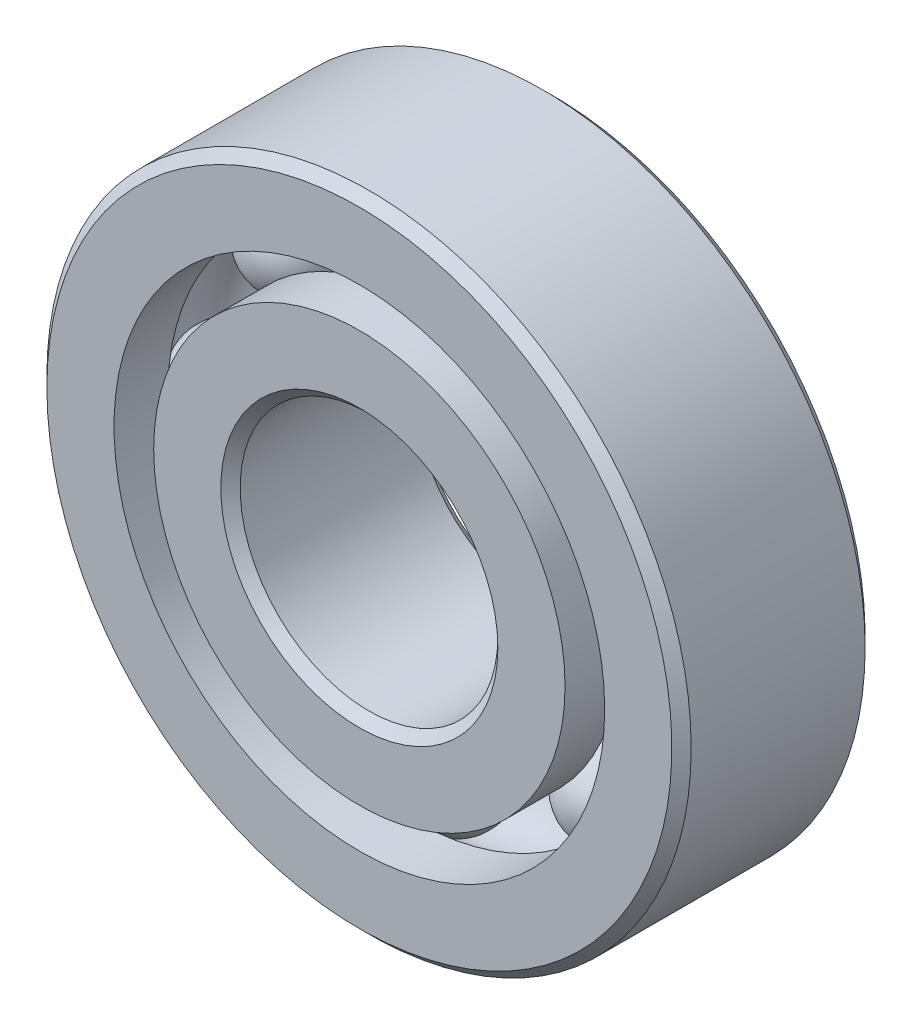
ISO-10303-21;
HEADER;
FILE_DESCRIPTION(('STEP AP214'),'2;1');
FILE_NAME('part.step','',(''),(''),'','','');
FILE_SCHEMA(('AUTOMOTIVE_DESIGN { 1 0 10303 214 1 1 1 1 }'));
ENDSEC;
DATA;
#1=APPLICATION_CONTEXT('core data for automotive mechanical design processes');
#2=APPLICATION_PROTOCOL_DEFINITION('international standard','automotive_design',2000,#1);
#3=PRODUCT_CONTEXT('',#1,'mechanical');
#4=PRODUCT('Part','Part','',(#3));
#5=PRODUCT_RELATED_PRODUCT_CATEGORY('part','',(#4));
#6=PRODUCT_DEFINITION_FORMATION('','',#4);
#7=PRODUCT_DEFINITION_CONTEXT('part definition',#1,'design');
#8=PRODUCT_DEFINITION('design','',#6,#7);
#9=PRODUCT_DEFINITION_SHAPE('','',#8);
#10=(LENGTH_UNIT() NAMED_UNIT(*) SI_UNIT(.MILLI.,.METRE.));
#11=(NAMED_UNIT(*) PLANE_ANGLE_UNIT() SI_UNIT($,.RADIAN.));
#12=(NAMED_UNIT(*) SI_UNIT($,.STERADIAN.) SOLID_ANGLE_UNIT());
#13=UNCERTAINTY_MEASURE_WITH_UNIT(LENGTH_MEASURE(1.E-05),#10,'distance_accuracy_value','');
#14=(GEOMETRIC_REPRESENTATION_CONTEXT(3) GLOBAL_UNCERTAINTY_ASSIGNED_CONTEXT((#13)) GLOBAL_UNIT_ASSIGNED_CONTEXT((#10,
#11,#12)) REPRESENTATION_CONTEXT('',''));
#15=CARTESIAN_POINT('',(0.,0.,0.));
#16=DIRECTION('',(0.,0.,1.));
#17=DIRECTION('',(1.,0.,0.));
#18=AXIS2_PLACEMENT_3D('',#15,#16,#17);
#19=CARTESIAN_POINT('',(3.92886205296776,3.92886205296775,0.));
#20=DIRECTION('',(0.707106781186549,0.707106781186546,0.));
#21=DIRECTION('',(0.,0.,-1.));
#22=AXIS2_PLACEMENT_3D('',#19,#20,#21);
#23=SPHERICAL_SURFACE('',#22,1.1656174839975);
#24=CARTESIAN_POINT('',(3.10464602576353,3.10464602576352,0.));
#25=VERTEX_POINT('',#24);
#26=VERTEX_LOOP('',#25);
#27=FACE_BOUND('',#26,.T.);
#28=CARTESIAN_POINT('',(4.753078080172,4.75307808017198,0.));
#29=VERTEX_POINT('',#28);
#30=VERTEX_LOOP('',#29);
#31=FACE_BOUND('',#30,.T.);
#32=ADVANCED_FACE('P0_F16',(#27,#31),#23,.T.);
#33=CLOSED_SHELL('',(#32));
#34=MANIFOLD_SOLID_BREP('P0_B1',#33);
#35=CARTESIAN_POINT('',(0.,-5.55625,0.));
#36=DIRECTION('',(0.,-1.,0.));
#37=DIRECTION('',(0.,0.,-1.));
#38=AXIS2_PLACEMENT_3D('',#35,#36,#37);
#39=SPHERICAL_SURFACE('',#38,1.1656174839975);
#40=CARTESIAN_POINT('',(0.,-4.3906325160025,0.));
#41=VERTEX_POINT('',#40);
#42=VERTEX_LOOP('',#41);
#43=FACE_BOUND('',#42,.T.);
#44=CARTESIAN_POINT('',(0.,-6.7218674839975,0.));
#45=VERTEX_POINT('',#44);
#46=VERTEX_LOOP('',#45);
#47=FACE_BOUND('',#46,.T.);
#48=ADVANCED_FACE('P1_F16',(#43,#47),#39,.T.);
#49=CLOSED_SHELL('',(#48));
#50=MANIFOLD_SOLID_BREP('P1_B1',#49);
#51=CARTESIAN_POINT('',(5.55625,0.,0.));
#52=DIRECTION('',(1.,0.,0.));
#53=DIRECTION('',(0.,0.,-1.));
#54=AXIS2_PLACEMENT_3D('',#51,#52,#53);
#55=SPHERICAL_SURFACE('',#54,1.1656174839975);
#56=CARTESIAN_POINT('',(6.7218674839975,0.,0.));
#57=VERTEX_POINT('',#56);
#58=VERTEX_LOOP('',#57);
#59=FACE_BOUND('',#58,.T.);
#60=CARTESIAN_POINT('',(4.3906325160025,0.,0.));
#61=VERTEX_POINT('',#60);
#62=VERTEX_LOOP('',#61);
#63=FACE_BOUND('',#62,.T.);
#64=ADVANCED_FACE('P2_F16',(#59,#63),#55,.T.);
#65=CLOSED_SHELL('',(#64));
#66=MANIFOLD_SOLID_BREP('P2_B1',#65);
#67=CARTESIAN_POINT('',(-5.55625,0.,0.));
#68=DIRECTION('',(-1.,0.,0.));
#69=DIRECTION('',(0.,0.,-1.));
#70=AXIS2_PLACEMENT_3D('',#67,#68,#69);
#71=SPHERICAL_SURFACE('',#70,1.1656174839975);
#72=CARTESIAN_POINT('',(-6.7218674839975,0.,0.));
#73=VERTEX_POINT('',#72);
#74=VERTEX_LOOP('',#73);
#75=FACE_BOUND('',#74,.T.);
#76=CARTESIAN_POINT('',(-4.3906325160025,0.,0.));
#77=VERTEX_POINT('',#76);
#78=VERTEX_LOOP('',#77);
#79=FACE_BOUND('',#78,.T.);
#80=ADVANCED_FACE('P3_F16',(#75,#79),#71,.T.);
#81=CLOSED_SHELL('',(#80));
#82=MANIFOLD_SOLID_BREP('P3_B1',#81);
#83=CARTESIAN_POINT('',(-3.92886205296779,-3.92886205296772,0.));
#84=DIRECTION('',(-0.707106781186554,-0.707106781186542,0.));
#85=DIRECTION('',(0.,0.,-1.));
#86=AXIS2_PLACEMENT_3D('',#83,#84,#85);
#87=SPHERICAL_SURFACE('',#86,1.1656174839975);
#88=CARTESIAN_POINT('',(-4.75307808017203,-4.75307808017195,0.));
#89=VERTEX_POINT('',#88);
#90=VERTEX_LOOP('',#89);
#91=FACE_BOUND('',#90,.T.);
#92=CARTESIAN_POINT('',(-3.10464602576355,-3.10464602576349,0.));
#93=VERTEX_POINT('',#92);
#94=VERTEX_LOOP('',#93);
#95=FACE_BOUND('',#94,.T.);
#96=ADVANCED_FACE('P4_F16',(#91,#95),#87,.T.);
#97=CLOSED_SHELL('',(#96));
#98=MANIFOLD_SOLID_BREP('P4_B1',#97);
#99=CARTESIAN_POINT('',(0.,5.55625,0.));
#100=DIRECTION('',(0.,1.,0.));
#101=DIRECTION('',(0.,0.,-1.));
#102=AXIS2_PLACEMENT_3D('',#99,#100,#101);
#103=SPHERICAL_SURFACE('',#102,1.1656174839975);
#104=CARTESIAN_POINT('',(0.,6.7218674839975,0.));
#105=VERTEX_POINT('',#104);
#106=VERTEX_LOOP('',#105);
#107=FACE_BOUND('',#106,.T.);
#108=CARTESIAN_POINT('',(0.,4.3906325160025,0.));
#109=VERTEX_POINT('',#108);
#110=VERTEX_LOOP('',#109);
#111=FACE_BOUND('',#110,.T.);
#112=ADVANCED_FACE('P5_F16',(#107,#111),#103,.T.);
#113=CLOSED_SHELL('',(#112));
#114=MANIFOLD_SOLID_BREP('P5_B1',#113);
#115=CARTESIAN_POINT('',(-3.92886205296771,3.9288620529678,0.));
#116=DIRECTION('',(-0.707106781186539,0.707106781186556,0.));
#117=DIRECTION('',(0.,0.,-1.));
#118=AXIS2_PLACEMENT_3D('',#115,#116,#117);
#119=SPHERICAL_SURFACE('',#118,1.1656174839975);
#120=CARTESIAN_POINT('',(-4.75307808017193,4.75307808017204,0.));
#121=VERTEX_POINT('',#120);
#122=VERTEX_LOOP('',#121);
#123=FACE_BOUND('',#122,.T.);
#124=CARTESIAN_POINT('',(-3.10464602576348,3.10464602576356,0.));
#125=VERTEX_POINT('',#124);
#126=VERTEX_LOOP('',#125);
#127=FACE_BOUND('',#126,.T.);
#128=ADVANCED_FACE('P6_F16',(#123,#127),#119,.T.);
#129=CLOSED_SHELL('',(#128));
#130=MANIFOLD_SOLID_BREP('P6_B1',#129);
#131=CARTESIAN_POINT('',(0.,0.,2.38125));
#132=DIRECTION('',(0.,0.,1.));
#133=DIRECTION('',(1.,0.,0.));
#134=AXIS2_PLACEMENT_3D('',#131,#132,#133);
#135=CYLINDRICAL_SURFACE('',#134,5.06778846153846);
#136=CARTESIAN_POINT('',(0.,0.,2.38125));
#137=DIRECTION('',(0.,0.,1.));
#138=DIRECTION('',(1.,0.,0.));
#139=AXIS2_PLACEMENT_3D('',#136,#137,#138);
#140=CIRCLE('',#139,5.06778846153846);
#141=CARTESIAN_POINT('',(5.06778846153846,0.,2.38125));
#142=VERTEX_POINT('',#141);
#143=EDGE_CURVE('P7_E18',#142,#142,#140,.F.);
#144=ORIENTED_EDGE('',*,*,#143,.T.);
#145=EDGE_LOOP('',(#144));
#146=FACE_BOUND('',#145,.T.);
#147=CARTESIAN_POINT('',(0.,0.,1.05833333333333));
#148=DIRECTION('',(0.,0.,1.));
#149=DIRECTION('',(1.,0.,0.));
#150=AXIS2_PLACEMENT_3D('',#147,#148,#149);
#151=CIRCLE('',#150,5.06778846153847);
#152=CARTESIAN_POINT('',(5.06778846153847,0.,1.05833333333333));
#153=VERTEX_POINT('',#152);
#154=EDGE_CURVE('P7_E30',#153,#153,#151,.T.);
#155=ORIENTED_EDGE('',*,*,#154,.T.);
#156=EDGE_LOOP('',(#155));
#157=FACE_BOUND('',#156,.T.);
#158=ADVANCED_FACE('P7_F15',(#146,#157),#135,.T.);
#159=CARTESIAN_POINT('',(0.,5.06778846153846,2.38125));
#160=DIRECTION('',(0.,0.,-1.));
#161=DIRECTION('',(-1.,0.,0.));
#162=AXIS2_PLACEMENT_3D('',#159,#160,#161);
#163=PLANE('',#162);
#164=ORIENTED_EDGE('',*,*,#143,.F.);
#165=EDGE_LOOP('',(#164));
#166=FACE_BOUND('',#165,.T.);
#167=CARTESIAN_POINT('',(0.,0.,2.3812499999849));
#168=DIRECTION('',(0.,0.,1.));
#169=DIRECTION('',(1.,0.,0.));
#170=AXIS2_PLACEMENT_3D('',#167,#168,#169);
#171=CIRCLE('',#170,3.41312500006552);
#172=CARTESIAN_POINT('',(3.41312500006552,0.,2.3812499999849));
#173=VERTEX_POINT('',#172);
#174=EDGE_CURVE('P7_E32',#173,#173,#171,.F.);
#175=ORIENTED_EDGE('',*,*,#174,.T.);
#176=EDGE_LOOP('',(#175));
#177=FACE_BOUND('',#176,.T.);
#178=ADVANCED_FACE('P7_F46',(#166,#177),#163,.F.);
#179=CARTESIAN_POINT('',(0.,0.,2.38124999987122));
#180=DIRECTION('',(0.,0.,1.));
#181=DIRECTION('',(1.,0.,0.));
#182=AXIS2_PLACEMENT_3D('',#179,#180,#181);
#183=CONICAL_SURFACE('',#182,3.41312499995183,0.785398163397448);
#184=ORIENTED_EDGE('',*,*,#174,.F.);
#185=EDGE_LOOP('',(#184));
#186=FACE_BOUND('',#185,.T.);
#187=CARTESIAN_POINT('',(0.,0.,2.14312500000001));
#188=DIRECTION('',(0.,0.,1.));
#189=DIRECTION('',(1.,0.,0.));
#190=AXIS2_PLACEMENT_3D('',#187,#188,#189);
#191=CIRCLE('',#190,3.175);
#192=CARTESIAN_POINT('',(3.175,0.,2.14312500000001));
#193=VERTEX_POINT('',#192);
#194=EDGE_CURVE('P7_E34',#193,#193,#191,.F.);
#195=ORIENTED_EDGE('',*,*,#194,.T.);
#196=EDGE_LOOP('',(#195));
#197=FACE_BOUND('',#196,.T.);
#198=ADVANCED_FACE('P7_F48',(#186,#197),#183,.F.);
#199=CARTESIAN_POINT('',(0.,0.,0.));
#200=DIRECTION('',(0.,0.,1.));
#201=DIRECTION('',(1.,0.,0.));
#202=AXIS2_PLACEMENT_3D('',#199,#200,#201);
#203=TOROIDAL_SURFACE('',#202,5.55625,1.16561748399749);
#204=ORIENTED_EDGE('',*,*,#154,.F.);
#205=EDGE_LOOP('',(#204));
#206=FACE_BOUND('',#205,.T.);
#207=CARTESIAN_POINT('',(0.,0.,-1.05833333333333));
#208=DIRECTION('',(0.,0.,1.));
#209=DIRECTION('',(1.,0.,0.));
#210=AXIS2_PLACEMENT_3D('',#207,#208,#209);
#211=CIRCLE('',#210,5.06778846153846);
#212=CARTESIAN_POINT('',(5.06778846153846,0.,-1.05833333333333));
#213=VERTEX_POINT('',#212);
#214=EDGE_CURVE('P7_E38',#213,#213,#211,.F.);
#215=ORIENTED_EDGE('',*,*,#214,.F.);
#216=EDGE_LOOP('',(#215));
#217=FACE_BOUND('',#216,.T.);
#218=ADVANCED_FACE('P7_F54',(#206,#217),#203,.F.);
#219=CARTESIAN_POINT('',(0.,0.,2.38125));
#220=DIRECTION('',(0.,0.,1.));
#221=DIRECTION('',(1.,0.,0.));
#222=AXIS2_PLACEMENT_3D('',#219,#220,#221);
#223=CYLINDRICAL_SURFACE('',#222,3.175);
#224=ORIENTED_EDGE('',*,*,#194,.F.);
#225=EDGE_LOOP('',(#224));
#226=FACE_BOUND('',#225,.T.);
#227=CARTESIAN_POINT('',(0.,0.,-2.14312499997504));
#228=DIRECTION('',(0.,0.,-1.));
#229=DIRECTION('',(-1.,0.,0.));
#230=AXIS2_PLACEMENT_3D('',#227,#228,#229);
#231=CIRCLE('',#230,3.17500000005566);
#232=CARTESIAN_POINT('',(-3.17500000005566,0.,-2.14312499997504));
#233=VERTEX_POINT('',#232);
#234=EDGE_CURVE('P7_E27',#233,#233,#231,.T.);
#235=ORIENTED_EDGE('',*,*,#234,.T.);
#236=EDGE_LOOP('',(#235));
#237=FACE_BOUND('',#236,.T.);
#238=ADVANCED_FACE('P7_F71',(#226,#237),#223,.F.);
#239=CARTESIAN_POINT('',(0.,0.,2.38125));
#240=DIRECTION('',(0.,0.,1.));
#241=DIRECTION('',(1.,0.,0.));
#242=AXIS2_PLACEMENT_3D('',#239,#240,#241);
#243=CYLINDRICAL_SURFACE('',#242,5.06778846153846);
#244=ORIENTED_EDGE('',*,*,#214,.T.);
#245=EDGE_LOOP('',(#244));
#246=FACE_BOUND('',#245,.T.);
#247=CARTESIAN_POINT('',(0.,0.,-2.38125));
#248=DIRECTION('',(0.,0.,1.));
#249=DIRECTION('',(1.,0.,0.));
#250=AXIS2_PLACEMENT_3D('',#247,#248,#249);
#251=CIRCLE('',#250,5.06778846153846);
#252=CARTESIAN_POINT('',(5.06778846153846,0.,-2.38125));
#253=VERTEX_POINT('',#252);
#254=EDGE_CURVE('P7_E22',#253,#253,#251,.T.);
#255=ORIENTED_EDGE('',*,*,#254,.T.);
#256=EDGE_LOOP('',(#255));
#257=FACE_BOUND('',#256,.T.);
#258=ADVANCED_FACE('P7_F65',(#246,#257),#243,.T.);
#259=CARTESIAN_POINT('',(0.,0.,-2.38124999992806));
#260=DIRECTION('',(0.,0.,-1.));
#261=DIRECTION('',(-1.,0.,0.));
#262=AXIS2_PLACEMENT_3D('',#259,#260,#261);
#263=CONICAL_SURFACE('',#262,3.41312500000868,0.785398163516805);
#264=CARTESIAN_POINT('',(0.,0.,-2.38124999992806));
#265=DIRECTION('',(0.,0.,-1.));
#266=DIRECTION('',(-1.,0.,0.));
#267=AXIS2_PLACEMENT_3D('',#264,#265,#266);
#268=CIRCLE('',#267,3.41312500000868);
#269=CARTESIAN_POINT('',(-3.41312500000868,0.,-2.38124999992806));
#270=VERTEX_POINT('',#269);
#271=EDGE_CURVE('P7_E10',#270,#270,#268,.T.);
#272=ORIENTED_EDGE('',*,*,#271,.T.);
#273=EDGE_LOOP('',(#272));
#274=FACE_BOUND('',#273,.T.);
#275=ORIENTED_EDGE('',*,*,#234,.F.);
#276=EDGE_LOOP('',(#275));
#277=FACE_BOUND('',#276,.T.);
#278=ADVANCED_FACE('P7_F59',(#274,#277),#263,.F.);
#279=CARTESIAN_POINT('',(0.,3.413125,-2.38125000000001));
#280=DIRECTION('',(0.,0.,1.));
#281=DIRECTION('',(1.,0.,0.));
#282=AXIS2_PLACEMENT_3D('',#279,#280,#281);
#283=PLANE('',#282);
#284=ORIENTED_EDGE('',*,*,#271,.F.);
#285=EDGE_LOOP('',(#284));
#286=FACE_BOUND('',#285,.T.);
#287=ORIENTED_EDGE('',*,*,#254,.F.);
#288=EDGE_LOOP('',(#287));
#289=FACE_BOUND('',#288,.T.);
#290=ADVANCED_FACE('P7_F57',(#286,#289),#283,.F.);
#291=CLOSED_SHELL('',(#158,#178,#198,#218,#238,#258,#278,#290));
#292=MANIFOLD_SOLID_BREP('P7_B1',#291);
#293=CARTESIAN_POINT('',(0.,0.,0.));
#294=DIRECTION('',(0.,0.,1.));
#295=DIRECTION('',(1.,0.,0.));
#296=AXIS2_PLACEMENT_3D('',#293,#294,#295);
#297=TOROIDAL_SURFACE('',#296,5.55625,1.1656174839975);
#298=CARTESIAN_POINT('',(0.,0.,-1.05833333333334));
#299=DIRECTION('',(0.,0.,1.));
#300=DIRECTION('',(1.,0.,0.));
#301=AXIS2_PLACEMENT_3D('',#298,#299,#300);
#302=CIRCLE('',#301,6.04471153846154);
#303=CARTESIAN_POINT('',(6.04471153846154,0.,-1.05833333333334));
#304=VERTEX_POINT('',#303);
#305=EDGE_CURVE('P8_E33',#304,#304,#302,.F.);
#306=ORIENTED_EDGE('',*,*,#305,.T.);
#307=EDGE_LOOP('',(#306));
#308=FACE_BOUND('',#307,.T.);
#309=CARTESIAN_POINT('',(0.,0.,1.05833333333333));
#310=DIRECTION('',(0.,0.,1.));
#311=DIRECTION('',(1.,0.,0.));
#312=AXIS2_PLACEMENT_3D('',#309,#310,#311);
#313=CIRCLE('',#312,6.04471153846154);
#314=CARTESIAN_POINT('',(6.04471153846154,0.,1.05833333333333));
#315=VERTEX_POINT('',#314);
#316=EDGE_CURVE('P8_E31',#315,#315,#313,.T.);
#317=ORIENTED_EDGE('',*,*,#316,.T.);
#318=EDGE_LOOP('',(#317));
#319=FACE_BOUND('',#318,.T.);
#320=ADVANCED_FACE('P8_F15',(#308,#319),#297,.F.);
#321=CARTESIAN_POINT('',(0.,0.,2.38125));
#322=DIRECTION('',(0.,0.,1.));
#323=DIRECTION('',(1.,0.,0.));
#324=AXIS2_PLACEMENT_3D('',#321,#322,#323);
#325=CYLINDRICAL_SURFACE('',#324,6.04471153846154);
#326=CARTESIAN_POINT('',(0.,0.,-2.38125000000001));
#327=DIRECTION('',(0.,0.,1.));
#328=DIRECTION('',(1.,0.,0.));
#329=AXIS2_PLACEMENT_3D('',#326,#327,#328);
#330=CIRCLE('',#329,6.04471153846154);
#331=CARTESIAN_POINT('',(6.04471153846154,0.,-2.38125000000001));
#332=VERTEX_POINT('',#331);
#333=EDGE_CURVE('P8_E19',#332,#332,#330,.F.);
#334=ORIENTED_EDGE('',*,*,#333,.T.);
#335=EDGE_LOOP('',(#334));
#336=FACE_BOUND('',#335,.T.);
#337=ORIENTED_EDGE('',*,*,#305,.F.);
#338=EDGE_LOOP('',(#337));
#339=FACE_BOUND('',#338,.T.);
#340=ADVANCED_FACE('P8_F49',(#336,#339),#325,.F.);
#341=CARTESIAN_POINT('',(0.,0.,2.38125));
#342=DIRECTION('',(0.,0.,1.));
#343=DIRECTION('',(1.,0.,0.));
#344=AXIS2_PLACEMENT_3D('',#341,#342,#343);
#345=CYLINDRICAL_SURFACE('',#344,6.04471153846154);
#346=ORIENTED_EDGE('',*,*,#316,.F.);
#347=EDGE_LOOP('',(#346));
#348=FACE_BOUND('',#347,.T.);
#349=CARTESIAN_POINT('',(0.,0.,2.38125));
#350=DIRECTION('',(0.,0.,1.));
#351=DIRECTION('',(1.,0.,0.));
#352=AXIS2_PLACEMENT_3D('',#349,#350,#351);
#353=CIRCLE('',#352,6.04471153846154);
#354=CARTESIAN_POINT('',(6.04471153846154,0.,2.38125));
#355=VERTEX_POINT('',#354);
#356=EDGE_CURVE('P8_E42',#355,#355,#353,.T.);
#357=ORIENTED_EDGE('',*,*,#356,.T.);
#358=EDGE_LOOP('',(#357));
#359=FACE_BOUND('',#358,.T.);
#360=ADVANCED_FACE('P8_F56',(#348,#359),#345,.F.);
#361=CARTESIAN_POINT('',(0.,7.699375,-2.38125000000001));
#362=DIRECTION('',(0.,0.,1.));
#363=DIRECTION('',(1.,0.,0.));
#364=AXIS2_PLACEMENT_3D('',#361,#362,#363);
#365=PLANE('',#364);
#366=ORIENTED_EDGE('',*,*,#333,.F.);
#367=EDGE_LOOP('',(#366));
#368=FACE_BOUND('',#367,.T.);
#369=CARTESIAN_POINT('',(0.,0.,-2.38125000000001));
#370=DIRECTION('',(0.,0.,1.));
#371=DIRECTION('',(0.,-1.,0.));
#372=AXIS2_PLACEMENT_3D('',#369,#370,#371);
#373=CIRCLE('',#372,7.699375);
#374=CARTESIAN_POINT('',(0.,-7.699375,-2.38125000000001));
#375=VERTEX_POINT('',#374);
#376=EDGE_CURVE('P8_E40',#375,#375,#373,.T.);
#377=ORIENTED_EDGE('',*,*,#376,.F.);
#378=EDGE_LOOP('',(#377));
#379=FACE_BOUND('',#378,.T.);
#380=ADVANCED_FACE('P8_F52',(#368,#379),#365,.F.);
#381=CARTESIAN_POINT('',(0.,7.699375,2.38125));
#382=DIRECTION('',(0.,0.,-1.));
#383=DIRECTION('',(-1.,0.,0.));
#384=AXIS2_PLACEMENT_3D('',#381,#382,#383);
#385=PLANE('',#384);
#386=CARTESIAN_POINT('',(0.,0.,2.38125));
#387=DIRECTION('',(0.,0.,-1.));
#388=DIRECTION('',(-1.,0.,0.));
#389=AXIS2_PLACEMENT_3D('',#386,#387,#388);
#390=CIRCLE('',#389,7.699375);
#391=CARTESIAN_POINT('',(-7.699375,0.,2.38125));
#392=VERTEX_POINT('',#391);
#393=EDGE_CURVE('P8_E28',#392,#392,#390,.T.);
#394=ORIENTED_EDGE('',*,*,#393,.F.);
#395=EDGE_LOOP('',(#394));
#396=FACE_BOUND('',#395,.T.);
#397=ORIENTED_EDGE('',*,*,#356,.F.);
#398=EDGE_LOOP('',(#397));
#399=FACE_BOUND('',#398,.T.);
#400=ADVANCED_FACE('P8_F55',(#396,#399),#385,.F.);
#401=CARTESIAN_POINT('',(0.,0.,-2.14312500000001));
#402=DIRECTION('',(0.,0.,1.));
#403=DIRECTION('',(0.,-1.,0.));
#404=AXIS2_PLACEMENT_3D('',#401,#402,#403);
#405=CONICAL_SURFACE('',#404,7.9375,0.785398163397444);
#406=CARTESIAN_POINT('',(0.,0.,-2.14312500000001));
#407=DIRECTION('',(0.,0.,1.));
#408=DIRECTION('',(1.,0.,0.));
#409=AXIS2_PLACEMENT_3D('',#406,#407,#408);
#410=CIRCLE('',#409,7.9375);
#411=CARTESIAN_POINT('',(7.9375,0.,-2.14312500000001));
#412=VERTEX_POINT('',#411);
#413=EDGE_CURVE('P8_E23',#412,#412,#410,.T.);
#414=ORIENTED_EDGE('',*,*,#413,.F.);
#415=EDGE_LOOP('',(#414));
#416=FACE_BOUND('',#415,.T.);
#417=ORIENTED_EDGE('',*,*,#376,.T.);
#418=EDGE_LOOP('',(#417));
#419=FACE_BOUND('',#418,.T.);
#420=ADVANCED_FACE('P8_F60',(#416,#419),#405,.T.);
#421=CARTESIAN_POINT('',(0.,0.,2.143125));
#422=DIRECTION('',(0.,0.,-1.));
#423=DIRECTION('',(-1.,0.,0.));
#424=AXIS2_PLACEMENT_3D('',#421,#422,#423);
#425=CONICAL_SURFACE('',#424,7.9375,0.785398163397446);
#426=CARTESIAN_POINT('',(0.,0.,2.143125));
#427=DIRECTION('',(0.,0.,1.));
#428=DIRECTION('',(1.,0.,0.));
#429=AXIS2_PLACEMENT_3D('',#426,#427,#428);
#430=CIRCLE('',#429,7.9375);
#431=CARTESIAN_POINT('',(7.9375,0.,2.143125));
#432=VERTEX_POINT('',#431);
#433=EDGE_CURVE('P8_E10',#432,#432,#430,.F.);
#434=ORIENTED_EDGE('',*,*,#433,.F.);
#435=EDGE_LOOP('',(#434));
#436=FACE_BOUND('',#435,.T.);
#437=ORIENTED_EDGE('',*,*,#393,.T.);
#438=EDGE_LOOP('',(#437));
#439=FACE_BOUND('',#438,.T.);
#440=ADVANCED_FACE('P8_F62',(#436,#439),#425,.T.);
#441=CARTESIAN_POINT('',(0.,0.,2.38125));
#442=DIRECTION('',(0.,0.,1.));
#443=DIRECTION('',(1.,0.,0.));
#444=AXIS2_PLACEMENT_3D('',#441,#442,#443);
#445=CYLINDRICAL_SURFACE('',#444,7.9375);
#446=ORIENTED_EDGE('',*,*,#433,.T.);
#447=EDGE_LOOP('',(#446));
#448=FACE_BOUND('',#447,.T.);
#449=ORIENTED_EDGE('',*,*,#413,.T.);
#450=EDGE_LOOP('',(#449));
#451=FACE_BOUND('',#450,.T.);
#452=ADVANCED_FACE('P8_F70',(#448,#451),#445,.T.);
#453=CLOSED_SHELL('',(#320,#340,#360,#380,#400,#420,#440,#452));
#454=MANIFOLD_SOLID_BREP('P8_B1',#453);
#455=CARTESIAN_POINT('',(3.92886205296773,-3.92886205296777,0.));
#456=DIRECTION('',(0.707106781186544,-0.707106781186551,0.));
#457=DIRECTION('',(0.,0.,-1.));
#458=AXIS2_PLACEMENT_3D('',#455,#456,#457);
#459=SPHERICAL_SURFACE('',#458,1.1656174839975);
#460=CARTESIAN_POINT('',(3.1046460257635,-3.10464602576354,0.));
#461=VERTEX_POINT('',#460);
#462=VERTEX_LOOP('',#461);
#463=FACE_BOUND('',#462,.T.);
#464=CARTESIAN_POINT('',(4.75307808017196,-4.75307808017201,0.));
#465=VERTEX_POINT('',#464);
#466=VERTEX_LOOP('',#465);
#467=FACE_BOUND('',#466,.T.);
#468=ADVANCED_FACE('P9_F16',(#463,#467),#459,.T.);
#469=CLOSED_SHELL('',(#468));
#470=MANIFOLD_SOLID_BREP('P9_B1',#469);
#471=ADVANCED_BREP_SHAPE_REPRESENTATION('',(#18,#34,#50,#66,#82,#98,#114,#130,#292,#454,#470),#14);
#472=SHAPE_DEFINITION_REPRESENTATION(#9,#471);
ENDSEC;
END-ISO-10303-21;
